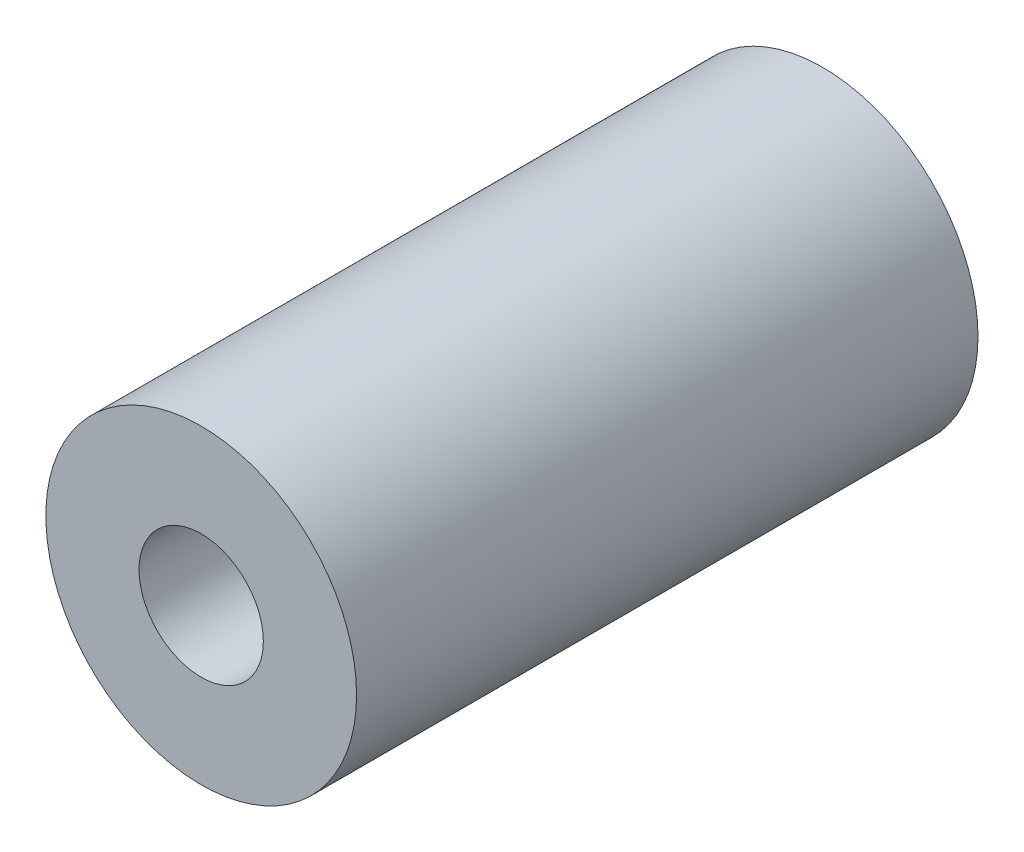
ISO-10303-21;
HEADER;
FILE_DESCRIPTION(('STEP AP214'),'2;1');
FILE_NAME('part.step','',(''),(''),'','','');
FILE_SCHEMA(('AUTOMOTIVE_DESIGN { 1 0 10303 214 1 1 1 1 }'));
ENDSEC;
DATA;
#1=APPLICATION_CONTEXT('core data for automotive mechanical design processes');
#2=APPLICATION_PROTOCOL_DEFINITION('international standard','automotive_design',2000,#1);
#3=PRODUCT_CONTEXT('',#1,'mechanical');
#4=PRODUCT('Part','Part','',(#3));
#5=PRODUCT_RELATED_PRODUCT_CATEGORY('part','',(#4));
#6=PRODUCT_DEFINITION_FORMATION('','',#4);
#7=PRODUCT_DEFINITION_CONTEXT('part definition',#1,'design');
#8=PRODUCT_DEFINITION('design','',#6,#7);
#9=PRODUCT_DEFINITION_SHAPE('','',#8);
#10=(LENGTH_UNIT() NAMED_UNIT(*) SI_UNIT(.MILLI.,.METRE.));
#11=(NAMED_UNIT(*) PLANE_ANGLE_UNIT() SI_UNIT($,.RADIAN.));
#12=(NAMED_UNIT(*) SI_UNIT($,.STERADIAN.) SOLID_ANGLE_UNIT());
#13=UNCERTAINTY_MEASURE_WITH_UNIT(LENGTH_MEASURE(1.E-05),#10,'distance_accuracy_value','');
#14=(GEOMETRIC_REPRESENTATION_CONTEXT(3) GLOBAL_UNCERTAINTY_ASSIGNED_CONTEXT((#13)) GLOBAL_UNIT_ASSIGNED_CONTEXT((#10,
#11,#12)) REPRESENTATION_CONTEXT('',''));
#15=CARTESIAN_POINT('',(0.,0.,0.));
#16=DIRECTION('',(0.,0.,1.));
#17=DIRECTION('',(1.,0.,0.));
#18=AXIS2_PLACEMENT_3D('',#15,#16,#17);
#19=CARTESIAN_POINT('',(0.,0.,-10.));
#20=DIRECTION('',(0.,0.,1.));
#21=DIRECTION('',(1.,0.,0.));
#22=AXIS2_PLACEMENT_3D('',#19,#20,#21);
#23=CYLINDRICAL_SURFACE('',#22,2.5);
#24=CARTESIAN_POINT('',(0.,0.,-10.));
#25=DIRECTION('',(0.,0.,1.));
#26=DIRECTION('',(1.,0.,0.));
#27=AXIS2_PLACEMENT_3D('',#24,#25,#26);
#28=CIRCLE('',#27,2.5);
#29=CARTESIAN_POINT('',(2.5,0.,-10.));
#30=VERTEX_POINT('',#29);
#31=EDGE_CURVE('E10',#30,#30,#28,.T.);
#32=ORIENTED_EDGE('',*,*,#31,.T.);
#33=EDGE_LOOP('',(#32));
#34=FACE_BOUND('',#33,.T.);
#35=CARTESIAN_POINT('',(0.,0.,0.));
#36=DIRECTION('',(0.,0.,1.));
#37=DIRECTION('',(1.,0.,0.));
#38=AXIS2_PLACEMENT_3D('',#35,#36,#37);
#39=CIRCLE('',#38,2.5);
#40=CARTESIAN_POINT('',(2.5,0.,0.));
#41=VERTEX_POINT('',#40);
#42=EDGE_CURVE('E34',#41,#41,#39,.T.);
#43=ORIENTED_EDGE('',*,*,#42,.F.);
#44=EDGE_LOOP('',(#43));
#45=FACE_BOUND('',#44,.T.);
#46=ADVANCED_FACE('F31',(#34,#45),#23,.T.);
#47=CARTESIAN_POINT('',(0.,0.,-10.));
#48=DIRECTION('',(0.,0.,1.));
#49=DIRECTION('',(1.,0.,0.));
#50=AXIS2_PLACEMENT_3D('',#47,#48,#49);
#51=PLANE('',#50);
#52=CARTESIAN_POINT('',(0.,0.,-10.));
#53=DIRECTION('',(0.,0.,1.));
#54=DIRECTION('',(1.,0.,0.));
#55=AXIS2_PLACEMENT_3D('',#52,#53,#54);
#56=CIRCLE('',#55,1.);
#57=CARTESIAN_POINT('',(1.,0.,-10.));
#58=VERTEX_POINT('',#57);
#59=EDGE_CURVE('E41',#58,#58,#56,.T.);
#60=ORIENTED_EDGE('',*,*,#59,.T.);
#61=EDGE_LOOP('',(#60));
#62=FACE_BOUND('',#61,.T.);
#63=ORIENTED_EDGE('',*,*,#31,.F.);
#64=EDGE_LOOP('',(#63));
#65=FACE_BOUND('',#64,.T.);
#66=ADVANCED_FACE('F49',(#62,#65),#51,.F.);
#67=CARTESIAN_POINT('',(0.,0.,0.));
#68=DIRECTION('',(0.,0.,1.));
#69=DIRECTION('',(1.,0.,0.));
#70=AXIS2_PLACEMENT_3D('',#67,#68,#69);
#71=PLANE('',#70);
#72=CARTESIAN_POINT('',(0.,0.,0.));
#73=DIRECTION('',(0.,0.,1.));
#74=DIRECTION('',(1.,0.,0.));
#75=AXIS2_PLACEMENT_3D('',#72,#73,#74);
#76=CIRCLE('',#75,1.);
#77=CARTESIAN_POINT('',(1.,0.,0.));
#78=VERTEX_POINT('',#77);
#79=EDGE_CURVE('E43',#78,#78,#76,.T.);
#80=ORIENTED_EDGE('',*,*,#79,.F.);
#81=EDGE_LOOP('',(#80));
#82=FACE_BOUND('',#81,.T.);
#83=ORIENTED_EDGE('',*,*,#42,.T.);
#84=EDGE_LOOP('',(#83));
#85=FACE_BOUND('',#84,.T.);
#86=ADVANCED_FACE('F55',(#82,#85),#71,.T.);
#87=CARTESIAN_POINT('',(0.,0.,-10.));
#88=DIRECTION('',(0.,0.,1.));
#89=DIRECTION('',(1.,0.,0.));
#90=AXIS2_PLACEMENT_3D('',#87,#88,#89);
#91=CYLINDRICAL_SURFACE('',#90,1.);
#92=ORIENTED_EDGE('',*,*,#59,.F.);
#93=EDGE_LOOP('',(#92));
#94=FACE_BOUND('',#93,.T.);
#95=ORIENTED_EDGE('',*,*,#79,.T.);
#96=EDGE_LOOP('',(#95));
#97=FACE_BOUND('',#96,.T.);
#98=ADVANCED_FACE('F52',(#94,#97),#91,.F.);
#99=CLOSED_SHELL('',(#46,#66,#86,#98));
#100=MANIFOLD_SOLID_BREP('B2',#99);
#101=ADVANCED_BREP_SHAPE_REPRESENTATION('',(#18,#100),#14);
#102=SHAPE_DEFINITION_REPRESENTATION(#9,#101);
ENDSEC;
END-ISO-10303-21;
